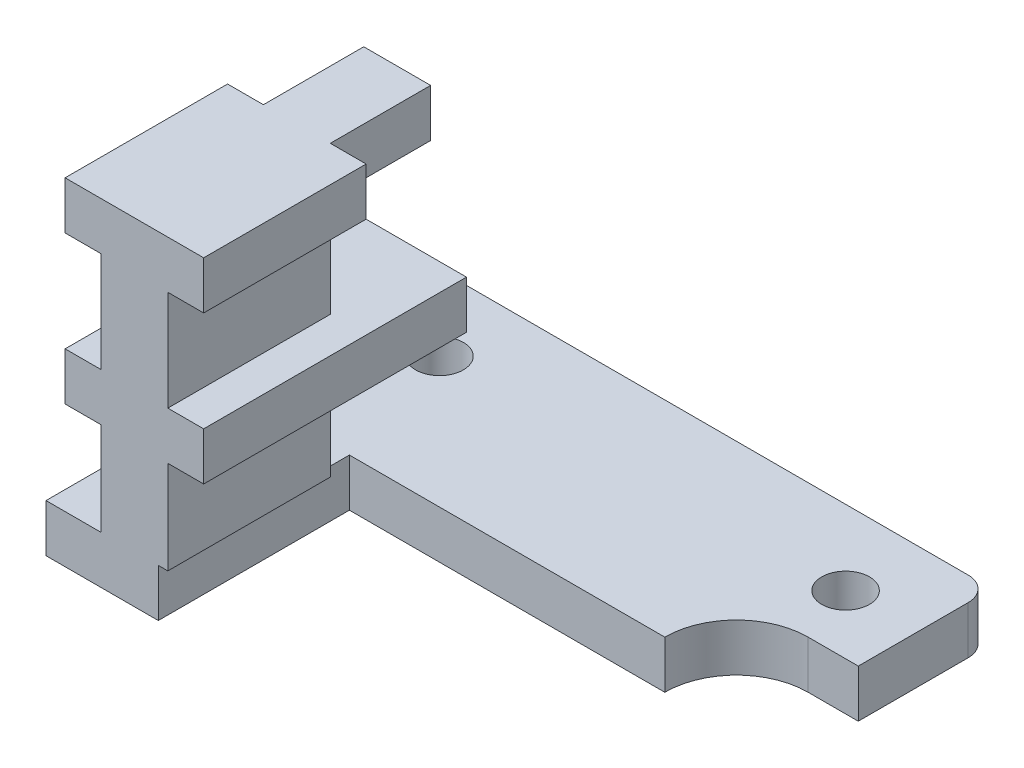
ISO-10303-21;
HEADER;
FILE_DESCRIPTION(('STEP AP214'),'2;1');
FILE_NAME('part.step','',(''),(''),'','','');
FILE_SCHEMA(('AUTOMOTIVE_DESIGN { 1 0 10303 214 1 1 1 1 }'));
ENDSEC;
DATA;
#1=APPLICATION_CONTEXT('core data for automotive mechanical design processes');
#2=APPLICATION_PROTOCOL_DEFINITION('international standard','automotive_design',2000,#1);
#3=PRODUCT_CONTEXT('',#1,'mechanical');
#4=PRODUCT('Part','Part','',(#3));
#5=PRODUCT_RELATED_PRODUCT_CATEGORY('part','',(#4));
#6=PRODUCT_DEFINITION_FORMATION('','',#4);
#7=PRODUCT_DEFINITION_CONTEXT('part definition',#1,'design');
#8=PRODUCT_DEFINITION('design','',#6,#7);
#9=PRODUCT_DEFINITION_SHAPE('','',#8);
#10=(LENGTH_UNIT() NAMED_UNIT(*) SI_UNIT(.MILLI.,.METRE.));
#11=(NAMED_UNIT(*) PLANE_ANGLE_UNIT() SI_UNIT($,.RADIAN.));
#12=(NAMED_UNIT(*) SI_UNIT($,.STERADIAN.) SOLID_ANGLE_UNIT());
#13=UNCERTAINTY_MEASURE_WITH_UNIT(LENGTH_MEASURE(1.E-05),#10,'distance_accuracy_value','');
#14=(GEOMETRIC_REPRESENTATION_CONTEXT(3) GLOBAL_UNCERTAINTY_ASSIGNED_CONTEXT((#13)) GLOBAL_UNIT_ASSIGNED_CONTEXT((#10,
#11,#12)) REPRESENTATION_CONTEXT('',''));
#15=CARTESIAN_POINT('',(0.,0.,0.));
#16=DIRECTION('',(0.,0.,1.));
#17=DIRECTION('',(1.,0.,0.));
#18=AXIS2_PLACEMENT_3D('',#15,#16,#17);
#19=CARTESIAN_POINT('',(-9.00000000000001,2.,1.2));
#20=DIRECTION('',(-1.,0.,0.));
#21=DIRECTION('',(0.,0.,1.));
#22=AXIS2_PLACEMENT_3D('',#19,#20,#21);
#23=PLANE('',#22);
#24=DIRECTION('',(0.,0.,-1.));
#25=VECTOR('',#24,1.);
#26=CARTESIAN_POINT('',(-9.00000000000001,7.9,1.2));
#27=LINE('',#26,#25);
#28=CARTESIAN_POINT('',(-9.00000000000001,7.9,8.));
#29=VERTEX_POINT('',#28);
#30=CARTESIAN_POINT('',(-9.00000000000001,7.9,1.2));
#31=VERTEX_POINT('',#30);
#32=EDGE_CURVE('E300',#29,#31,#27,.T.);
#33=ORIENTED_EDGE('',*,*,#32,.F.);
#34=DIRECTION('',(0.,-1.,0.));
#35=VECTOR('',#34,1.);
#36=CARTESIAN_POINT('',(-9.00000000000001,2.,8.));
#37=LINE('',#36,#35);
#38=CARTESIAN_POINT('',(-9.00000000000001,12.1,8.));
#39=VERTEX_POINT('',#38);
#40=EDGE_CURVE('E371',#39,#29,#37,.T.);
#41=ORIENTED_EDGE('',*,*,#40,.F.);
#42=DIRECTION('',(0.,0.,1.));
#43=VECTOR('',#42,1.);
#44=CARTESIAN_POINT('',(-9.00000000000001,12.1,1.2));
#45=LINE('',#44,#43);
#46=CARTESIAN_POINT('',(-9.00000000000001,12.1,1.2));
#47=VERTEX_POINT('',#46);
#48=EDGE_CURVE('E402',#47,#39,#45,.T.);
#49=ORIENTED_EDGE('',*,*,#48,.F.);
#50=DIRECTION('',(0.,-1.,0.));
#51=VECTOR('',#50,1.);
#52=CARTESIAN_POINT('',(-9.00000000000001,2.,1.2));
#53=LINE('',#52,#51);
#54=EDGE_CURVE('E335',#47,#31,#53,.T.);
#55=ORIENTED_EDGE('',*,*,#54,.T.);
#56=EDGE_LOOP('',(#33,#41,#49,#55));
#57=FACE_BOUND('',#56,.T.);
#58=ADVANCED_FACE('F39',(#57),#23,.T.);
#59=CARTESIAN_POINT('',(-6.2,2.,1.2));
#60=DIRECTION('',(1.,0.,0.));
#61=DIRECTION('',(0.,0.,-1.));
#62=AXIS2_PLACEMENT_3D('',#59,#60,#61);
#63=PLANE('',#62);
#64=DIRECTION('',(0.,0.,1.));
#65=VECTOR('',#64,1.);
#66=CARTESIAN_POINT('',(-6.2,7.9,1.2));
#67=LINE('',#66,#65);
#68=CARTESIAN_POINT('',(-6.2,7.9,1.2));
#69=VERTEX_POINT('',#68);
#70=CARTESIAN_POINT('',(-6.2,7.9,8.));
#71=VERTEX_POINT('',#70);
#72=EDGE_CURVE('E297',#69,#71,#67,.T.);
#73=ORIENTED_EDGE('',*,*,#72,.F.);
#74=DIRECTION('',(0.,1.,0.));
#75=VECTOR('',#74,1.);
#76=CARTESIAN_POINT('',(-6.2,2.,1.2));
#77=LINE('',#76,#75);
#78=CARTESIAN_POINT('',(-6.2,12.1,1.2));
#79=VERTEX_POINT('',#78);
#80=EDGE_CURVE('E344',#69,#79,#77,.T.);
#81=ORIENTED_EDGE('',*,*,#80,.T.);
#82=DIRECTION('',(0.,0.,1.));
#83=VECTOR('',#82,1.);
#84=CARTESIAN_POINT('',(-6.2,12.1,1.2));
#85=LINE('',#84,#83);
#86=CARTESIAN_POINT('',(-6.2,12.1,8.));
#87=VERTEX_POINT('',#86);
#88=EDGE_CURVE('E419',#79,#87,#85,.T.);
#89=ORIENTED_EDGE('',*,*,#88,.T.);
#90=DIRECTION('',(0.,1.,0.));
#91=VECTOR('',#90,1.);
#92=CARTESIAN_POINT('',(-6.2,2.,8.));
#93=LINE('',#92,#91);
#94=EDGE_CURVE('E378',#71,#87,#93,.T.);
#95=ORIENTED_EDGE('',*,*,#94,.F.);
#96=EDGE_LOOP('',(#73,#81,#89,#95));
#97=FACE_BOUND('',#96,.T.);
#98=ADVANCED_FACE('F618',(#97),#63,.T.);
#99=CARTESIAN_POINT('',(0.,0.,1.2));
#100=DIRECTION('',(0.,0.,1.));
#101=DIRECTION('',(1.,0.,0.));
#102=AXIS2_PLACEMENT_3D('',#99,#100,#101);
#103=PLANE('',#102);
#104=ORIENTED_EDGE('',*,*,#80,.F.);
#105=DIRECTION('',(-1.,0.,0.));
#106=VECTOR('',#105,1.);
#107=CARTESIAN_POINT('',(0.,7.9,1.2));
#108=LINE('',#107,#106);
#109=EDGE_CURVE('E11',#69,#31,#108,.T.);
#110=ORIENTED_EDGE('',*,*,#109,.T.);
#111=ORIENTED_EDGE('',*,*,#54,.F.);
#112=DIRECTION('',(1.,0.,0.));
#113=VECTOR('',#112,1.);
#114=CARTESIAN_POINT('',(0.,12.1,1.2));
#115=LINE('',#114,#113);
#116=EDGE_CURVE('E549',#47,#79,#115,.T.);
#117=ORIENTED_EDGE('',*,*,#116,.T.);
#118=EDGE_LOOP('',(#104,#110,#111,#117));
#119=FACE_BOUND('',#118,.T.);
#120=ADVANCED_FACE('F634',(#119),#103,.F.);
#121=DIRECTION('',(-1.,0.,0.));
#122=VECTOR('',#121,1.);
#123=CARTESIAN_POINT('',(-6.6,14.1,1.2));
#124=LINE('',#123,#122);
#125=CARTESIAN_POINT('',(-9.00000000000001,14.1,1.2));
#126=VERTEX_POINT('',#125);
#127=CARTESIAN_POINT('',(-10.5,14.1,1.2));
#128=VERTEX_POINT('',#127);
#129=EDGE_CURVE('E357',#126,#128,#124,.T.);
#130=ORIENTED_EDGE('',*,*,#129,.F.);
#131=DIRECTION('',(0.,-1.,0.));
#132=VECTOR('',#131,1.);
#133=CARTESIAN_POINT('',(-9.00000000000001,0.,1.2));
#134=LINE('',#133,#132);
#135=EDGE_CURVE('E557',#126,#47,#134,.T.);
#136=ORIENTED_EDGE('',*,*,#135,.T.);
#137=DIRECTION('',(1.,0.,0.));
#138=VECTOR('',#137,1.);
#139=CARTESIAN_POINT('',(-6.6,12.1,1.2));
#140=LINE('',#139,#138);
#141=CARTESIAN_POINT('',(-10.5,12.1,1.2));
#142=VERTEX_POINT('',#141);
#143=EDGE_CURVE('E366',#142,#47,#140,.T.);
#144=ORIENTED_EDGE('',*,*,#143,.F.);
#145=DIRECTION('',(0.,-1.,0.));
#146=VECTOR('',#145,1.);
#147=CARTESIAN_POINT('',(-10.5,2.,1.2));
#148=LINE('',#147,#146);
#149=EDGE_CURVE('E362',#128,#142,#148,.T.);
#150=ORIENTED_EDGE('',*,*,#149,.F.);
#151=EDGE_LOOP('',(#130,#136,#144,#150));
#152=FACE_BOUND('',#151,.T.);
#153=ADVANCED_FACE('F658',(#152),#103,.F.);
#154=DIRECTION('',(1.,0.,0.));
#155=VECTOR('',#154,1.);
#156=CARTESIAN_POINT('',(-6.6,12.1,1.2));
#157=LINE('',#156,#155);
#158=CARTESIAN_POINT('',(-4.7,12.1,1.2));
#159=VERTEX_POINT('',#158);
#160=EDGE_CURVE('E349',#79,#159,#157,.T.);
#161=ORIENTED_EDGE('',*,*,#160,.F.);
#162=DIRECTION('',(0.,1.,0.));
#163=VECTOR('',#162,1.);
#164=CARTESIAN_POINT('',(-6.2,0.,1.2));
#165=LINE('',#164,#163);
#166=CARTESIAN_POINT('',(-6.2,14.1,1.2));
#167=VERTEX_POINT('',#166);
#168=EDGE_CURVE('E553',#79,#167,#165,.T.);
#169=ORIENTED_EDGE('',*,*,#168,.T.);
#170=CARTESIAN_POINT('',(-4.70000000000001,14.1,1.2));
#171=VERTEX_POINT('',#170);
#172=EDGE_CURVE('E358',#171,#167,#124,.T.);
#173=ORIENTED_EDGE('',*,*,#172,.F.);
#174=DIRECTION('',(0.,1.,0.));
#175=VECTOR('',#174,1.);
#176=CARTESIAN_POINT('',(-4.7,2.,1.2));
#177=LINE('',#176,#175);
#178=EDGE_CURVE('E353',#159,#171,#177,.T.);
#179=ORIENTED_EDGE('',*,*,#178,.F.);
#180=EDGE_LOOP('',(#161,#169,#173,#179));
#181=FACE_BOUND('',#180,.T.);
#182=ADVANCED_FACE('F638',(#181),#103,.F.);
#183=CARTESIAN_POINT('',(9.6,2.,0.));
#184=DIRECTION('',(0.,1.,0.));
#185=DIRECTION('',(0.,0.,1.));
#186=AXIS2_PLACEMENT_3D('',#183,#184,#185);
#187=PLANE('',#186);
#188=DIRECTION('',(0.,0.,1.));
#189=VECTOR('',#188,1.);
#190=CARTESIAN_POINT('',(-9.00000000000001,2.,1.2));
#191=LINE('',#190,#189);
#192=CARTESIAN_POINT('',(-9.00000000000001,2.,1.2));
#193=VERTEX_POINT('',#192);
#194=CARTESIAN_POINT('',(-9.00000000000001,2.,8.));
#195=VERTEX_POINT('',#194);
#196=EDGE_CURVE('E370',#193,#195,#191,.T.);
#197=ORIENTED_EDGE('',*,*,#196,.F.);
#198=DIRECTION('',(1.,0.,0.));
#199=VECTOR('',#198,1.);
#200=CARTESIAN_POINT('',(-6.6,2.,1.2));
#201=LINE('',#200,#199);
#202=CARTESIAN_POINT('',(-6.6,2.,1.2));
#203=VERTEX_POINT('',#202);
#204=EDGE_CURVE('E340',#193,#203,#201,.T.);
#205=ORIENTED_EDGE('',*,*,#204,.T.);
#206=DIRECTION('',(0.,0.,-1.));
#207=VECTOR('',#206,1.);
#208=CARTESIAN_POINT('',(-6.6,2.,0.));
#209=LINE('',#208,#207);
#210=CARTESIAN_POINT('',(-6.6,2.,0.));
#211=VERTEX_POINT('',#210);
#212=EDGE_CURVE('E470',#203,#211,#209,.T.);
#213=ORIENTED_EDGE('',*,*,#212,.T.);
#214=DIRECTION('',(1.,0.,0.));
#215=VECTOR('',#214,1.);
#216=CARTESIAN_POINT('',(-6.6,2.,0.));
#217=LINE('',#216,#215);
#218=CARTESIAN_POINT('',(6.6,2.,0.));
#219=VERTEX_POINT('',#218);
#220=EDGE_CURVE('E474',#211,#219,#217,.T.);
#221=ORIENTED_EDGE('',*,*,#220,.T.);
#222=CARTESIAN_POINT('',(9.6,2.,0.));
#223=DIRECTION('',(0.,-1.,0.));
#224=DIRECTION('',(0.,0.,1.));
#225=AXIS2_PLACEMENT_3D('',#222,#223,#224);
#226=CIRCLE('',#225,3.);
#227=CARTESIAN_POINT('',(9.6,2.,-3.));
#228=VERTEX_POINT('',#227);
#229=EDGE_CURVE('E477',#219,#228,#226,.T.);
#230=ORIENTED_EDGE('',*,*,#229,.T.);
#231=DIRECTION('',(1.,0.,0.));
#232=VECTOR('',#231,1.);
#233=CARTESIAN_POINT('',(11.7,2.,-3.));
#234=LINE('',#233,#232);
#235=CARTESIAN_POINT('',(11.7,2.,-3.));
#236=VERTEX_POINT('',#235);
#237=EDGE_CURVE('E446',#228,#236,#234,.T.);
#238=ORIENTED_EDGE('',*,*,#237,.T.);
#239=DIRECTION('',(0.,0.,-1.));
#240=VECTOR('',#239,1.);
#241=CARTESIAN_POINT('',(11.7,2.,-3.));
#242=LINE('',#241,#240);
#243=CARTESIAN_POINT('',(11.7,2.,-7.6));
#244=VERTEX_POINT('',#243);
#245=EDGE_CURVE('E450',#236,#244,#242,.T.);
#246=ORIENTED_EDGE('',*,*,#245,.T.);
#247=CARTESIAN_POINT('',(10.7,2.,-7.6));
#248=DIRECTION('',(0.,1.,0.));
#249=DIRECTION('',(0.,0.,1.));
#250=AXIS2_PLACEMENT_3D('',#247,#248,#249);
#251=CIRCLE('',#250,1.);
#252=CARTESIAN_POINT('',(10.7,2.,-8.60000000000001));
#253=VERTEX_POINT('',#252);
#254=EDGE_CURVE('E454',#244,#253,#251,.T.);
#255=ORIENTED_EDGE('',*,*,#254,.T.);
#256=DIRECTION('',(-1.,0.,0.));
#257=VECTOR('',#256,1.);
#258=CARTESIAN_POINT('',(10.7,2.,-8.60000000000001));
#259=LINE('',#258,#257);
#260=CARTESIAN_POINT('',(-10.3,2.,-8.6));
#261=VERTEX_POINT('',#260);
#262=EDGE_CURVE('E457',#253,#261,#259,.T.);
#263=ORIENTED_EDGE('',*,*,#262,.T.);
#264=CARTESIAN_POINT('',(-10.3,2.,-7.6));
#265=DIRECTION('',(0.,1.,0.));
#266=DIRECTION('',(0.,0.,1.));
#267=AXIS2_PLACEMENT_3D('',#264,#265,#266);
#268=CIRCLE('',#267,1.);
#269=CARTESIAN_POINT('',(-11.3,2.,-7.6));
#270=VERTEX_POINT('',#269);
#271=EDGE_CURVE('E460',#261,#270,#268,.T.);
#272=ORIENTED_EDGE('',*,*,#271,.T.);
#273=DIRECTION('',(0.,0.,1.));
#274=VECTOR('',#273,1.);
#275=CARTESIAN_POINT('',(-11.3,2.,8.));
#276=LINE('',#275,#274);
#277=CARTESIAN_POINT('',(-11.3,2.,8.));
#278=VERTEX_POINT('',#277);
#279=EDGE_CURVE('E463',#270,#278,#276,.T.);
#280=ORIENTED_EDGE('',*,*,#279,.T.);
#281=DIRECTION('',(1.,0.,0.));
#282=VECTOR('',#281,1.);
#283=CARTESIAN_POINT('',(-6.6,2.,8.));
#284=LINE('',#283,#282);
#285=EDGE_CURVE('E466',#278,#195,#284,.T.);
#286=ORIENTED_EDGE('',*,*,#285,.T.);
#287=EDGE_LOOP('',(#197,#205,#213,#221,#230,#238,#246,#255,#263,#272,#280,#286));
#288=FACE_BOUND('',#287,.T.);
#289=CARTESIAN_POINT('',(-8.3,2.,-5.46956521739131));
#290=DIRECTION('',(0.,1.,0.));
#291=DIRECTION('',(0.,0.,1.));
#292=AXIS2_PLACEMENT_3D('',#289,#290,#291);
#293=CIRCLE('',#292,1.);
#294=CARTESIAN_POINT('',(-8.3,2.,-4.46956521739131));
#295=VERTEX_POINT('',#294);
#296=EDGE_CURVE('E438',#295,#295,#293,.T.);
#297=ORIENTED_EDGE('',*,*,#296,.F.);
#298=EDGE_LOOP('',(#297));
#299=FACE_BOUND('',#298,.T.);
#300=CARTESIAN_POINT('',(8.7,2.,-5.46956521739131));
#301=DIRECTION('',(0.,1.,0.));
#302=DIRECTION('',(0.,0.,1.));
#303=AXIS2_PLACEMENT_3D('',#300,#301,#302);
#304=CIRCLE('',#303,1.);
#305=CARTESIAN_POINT('',(8.7,2.,-4.46956521739131));
#306=VERTEX_POINT('',#305);
#307=EDGE_CURVE('E430',#306,#306,#304,.T.);
#308=ORIENTED_EDGE('',*,*,#307,.F.);
#309=EDGE_LOOP('',(#308));
#310=FACE_BOUND('',#309,.T.);
#311=ADVANCED_FACE('F585',(#288,#299,#310),#187,.T.);
#312=CARTESIAN_POINT('',(9.6,0.,0.));
#313=DIRECTION('',(0.,1.,0.));
#314=DIRECTION('',(0.,0.,1.));
#315=AXIS2_PLACEMENT_3D('',#312,#313,#314);
#316=PLANE('',#315);
#317=DIRECTION('',(1.,0.,0.));
#318=VECTOR('',#317,1.);
#319=CARTESIAN_POINT('',(11.7,0.,-3.));
#320=LINE('',#319,#318);
#321=CARTESIAN_POINT('',(9.6,0.,-3.));
#322=VERTEX_POINT('',#321);
#323=CARTESIAN_POINT('',(11.7,0.,-3.));
#324=VERTEX_POINT('',#323);
#325=EDGE_CURVE('E442',#322,#324,#320,.T.);
#326=ORIENTED_EDGE('',*,*,#325,.F.);
#327=CARTESIAN_POINT('',(9.6,0.,0.));
#328=DIRECTION('',(0.,-1.,0.));
#329=DIRECTION('',(0.,0.,1.));
#330=AXIS2_PLACEMENT_3D('',#327,#328,#329);
#331=CIRCLE('',#330,3.);
#332=CARTESIAN_POINT('',(6.6,0.,0.));
#333=VERTEX_POINT('',#332);
#334=EDGE_CURVE('E451',#333,#322,#331,.T.);
#335=ORIENTED_EDGE('',*,*,#334,.F.);
#336=DIRECTION('',(1.,0.,0.));
#337=VECTOR('',#336,1.);
#338=CARTESIAN_POINT('',(-6.6,0.,0.));
#339=LINE('',#338,#337);
#340=CARTESIAN_POINT('',(-6.6,0.,0.));
#341=VERTEX_POINT('',#340);
#342=EDGE_CURVE('E505',#341,#333,#339,.T.);
#343=ORIENTED_EDGE('',*,*,#342,.F.);
#344=DIRECTION('',(0.,0.,-1.));
#345=VECTOR('',#344,1.);
#346=CARTESIAN_POINT('',(-6.6,0.,0.));
#347=LINE('',#346,#345);
#348=CARTESIAN_POINT('',(-6.6,0.,8.));
#349=VERTEX_POINT('',#348);
#350=EDGE_CURVE('E502',#349,#341,#347,.T.);
#351=ORIENTED_EDGE('',*,*,#350,.F.);
#352=DIRECTION('',(1.,0.,0.));
#353=VECTOR('',#352,1.);
#354=CARTESIAN_POINT('',(-6.6,0.,8.));
#355=LINE('',#354,#353);
#356=CARTESIAN_POINT('',(-11.3,0.,8.));
#357=VERTEX_POINT('',#356);
#358=EDGE_CURVE('E499',#357,#349,#355,.T.);
#359=ORIENTED_EDGE('',*,*,#358,.F.);
#360=DIRECTION('',(0.,0.,1.));
#361=VECTOR('',#360,1.);
#362=CARTESIAN_POINT('',(-11.3,0.,8.));
#363=LINE('',#362,#361);
#364=CARTESIAN_POINT('',(-11.3,0.,-7.6));
#365=VERTEX_POINT('',#364);
#366=EDGE_CURVE('E496',#365,#357,#363,.T.);
#367=ORIENTED_EDGE('',*,*,#366,.F.);
#368=CARTESIAN_POINT('',(-10.3,0.,-7.6));
#369=DIRECTION('',(0.,1.,0.));
#370=DIRECTION('',(0.,0.,1.));
#371=AXIS2_PLACEMENT_3D('',#368,#369,#370);
#372=CIRCLE('',#371,1.);
#373=CARTESIAN_POINT('',(-10.3,0.,-8.6));
#374=VERTEX_POINT('',#373);
#375=EDGE_CURVE('E493',#374,#365,#372,.T.);
#376=ORIENTED_EDGE('',*,*,#375,.F.);
#377=DIRECTION('',(-1.,0.,0.));
#378=VECTOR('',#377,1.);
#379=CARTESIAN_POINT('',(10.7,0.,-8.60000000000001));
#380=LINE('',#379,#378);
#381=CARTESIAN_POINT('',(10.7,0.,-8.60000000000001));
#382=VERTEX_POINT('',#381);
#383=EDGE_CURVE('E490',#382,#374,#380,.T.);
#384=ORIENTED_EDGE('',*,*,#383,.F.);
#385=CARTESIAN_POINT('',(10.7,0.,-7.6));
#386=DIRECTION('',(0.,1.,0.));
#387=DIRECTION('',(0.,0.,1.));
#388=AXIS2_PLACEMENT_3D('',#385,#386,#387);
#389=CIRCLE('',#388,1.);
#390=CARTESIAN_POINT('',(11.7,0.,-7.6));
#391=VERTEX_POINT('',#390);
#392=EDGE_CURVE('E487',#391,#382,#389,.T.);
#393=ORIENTED_EDGE('',*,*,#392,.F.);
#394=DIRECTION('',(0.,0.,-1.));
#395=VECTOR('',#394,1.);
#396=CARTESIAN_POINT('',(11.7,0.,-3.));
#397=LINE('',#396,#395);
#398=EDGE_CURVE('E484',#324,#391,#397,.T.);
#399=ORIENTED_EDGE('',*,*,#398,.F.);
#400=EDGE_LOOP('',(#326,#335,#343,#351,#359,#367,#376,#384,#393,#399));
#401=FACE_BOUND('',#400,.T.);
#402=CARTESIAN_POINT('',(-8.3,0.,-5.46956521739131));
#403=DIRECTION('',(0.,1.,0.));
#404=DIRECTION('',(0.,0.,1.));
#405=AXIS2_PLACEMENT_3D('',#402,#403,#404);
#406=CIRCLE('',#405,1.);
#407=CARTESIAN_POINT('',(-8.3,0.,-4.46956521739131));
#408=VERTEX_POINT('',#407);
#409=EDGE_CURVE('E434',#408,#408,#406,.T.);
#410=ORIENTED_EDGE('',*,*,#409,.T.);
#411=EDGE_LOOP('',(#410));
#412=FACE_BOUND('',#411,.T.);
#413=CARTESIAN_POINT('',(8.7,0.,-5.46956521739131));
#414=DIRECTION('',(0.,1.,0.));
#415=DIRECTION('',(0.,0.,1.));
#416=AXIS2_PLACEMENT_3D('',#413,#414,#415);
#417=CIRCLE('',#416,1.);
#418=CARTESIAN_POINT('',(8.7,0.,-4.46956521739131));
#419=VERTEX_POINT('',#418);
#420=EDGE_CURVE('E405',#419,#419,#417,.T.);
#421=ORIENTED_EDGE('',*,*,#420,.T.);
#422=EDGE_LOOP('',(#421));
#423=FACE_BOUND('',#422,.T.);
#424=ADVANCED_FACE('F598',(#401,#412,#423),#316,.F.);
#425=CARTESIAN_POINT('',(11.7,2.,-3.));
#426=DIRECTION('',(0.,0.,-1.));
#427=DIRECTION('',(-1.,0.,0.));
#428=AXIS2_PLACEMENT_3D('',#425,#426,#427);
#429=PLANE('',#428);
#430=ORIENTED_EDGE('',*,*,#325,.T.);
#431=DIRECTION('',(0.,-1.,0.));
#432=VECTOR('',#431,1.);
#433=CARTESIAN_POINT('',(11.7,2.,-3.));
#434=LINE('',#433,#432);
#435=EDGE_CURVE('E545',#236,#324,#434,.T.);
#436=ORIENTED_EDGE('',*,*,#435,.F.);
#437=ORIENTED_EDGE('',*,*,#237,.F.);
#438=DIRECTION('',(0.,-1.,0.));
#439=VECTOR('',#438,1.);
#440=CARTESIAN_POINT('',(9.6,2.,-3.));
#441=LINE('',#440,#439);
#442=EDGE_CURVE('E480',#228,#322,#441,.T.);
#443=ORIENTED_EDGE('',*,*,#442,.T.);
#444=EDGE_LOOP('',(#430,#436,#437,#443));
#445=FACE_BOUND('',#444,.T.);
#446=ADVANCED_FACE('F41',(#445),#429,.F.);
#447=CARTESIAN_POINT('',(11.7,2.,-3.));
#448=DIRECTION('',(-1.,0.,0.));
#449=DIRECTION('',(0.,0.,1.));
#450=AXIS2_PLACEMENT_3D('',#447,#448,#449);
#451=PLANE('',#450);
#452=ORIENTED_EDGE('',*,*,#398,.T.);
#453=DIRECTION('',(0.,-1.,0.));
#454=VECTOR('',#453,1.);
#455=CARTESIAN_POINT('',(11.7,2.,-7.6));
#456=LINE('',#455,#454);
#457=EDGE_CURVE('E541',#244,#391,#456,.T.);
#458=ORIENTED_EDGE('',*,*,#457,.F.);
#459=ORIENTED_EDGE('',*,*,#245,.F.);
#460=ORIENTED_EDGE('',*,*,#435,.T.);
#461=EDGE_LOOP('',(#452,#458,#459,#460));
#462=FACE_BOUND('',#461,.T.);
#463=ADVANCED_FACE('F728',(#462),#451,.F.);
#464=CARTESIAN_POINT('',(10.7,2.,-7.6));
#465=DIRECTION('',(0.,-1.,0.));
#466=DIRECTION('',(0.,0.,-1.));
#467=AXIS2_PLACEMENT_3D('',#464,#465,#466);
#468=CYLINDRICAL_SURFACE('',#467,1.);
#469=ORIENTED_EDGE('',*,*,#392,.T.);
#470=DIRECTION('',(0.,-1.,0.));
#471=VECTOR('',#470,1.);
#472=CARTESIAN_POINT('',(10.7,2.,-8.60000000000001));
#473=LINE('',#472,#471);
#474=EDGE_CURVE('E537',#253,#382,#473,.T.);
#475=ORIENTED_EDGE('',*,*,#474,.F.);
#476=ORIENTED_EDGE('',*,*,#254,.F.);
#477=ORIENTED_EDGE('',*,*,#457,.T.);
#478=EDGE_LOOP('',(#469,#475,#476,#477));
#479=FACE_BOUND('',#478,.T.);
#480=ADVANCED_FACE('F725',(#479),#468,.T.);
#481=CARTESIAN_POINT('',(10.7,2.,-8.60000000000001));
#482=DIRECTION('',(0.,0.,1.));
#483=DIRECTION('',(1.,0.,0.));
#484=AXIS2_PLACEMENT_3D('',#481,#482,#483);
#485=PLANE('',#484);
#486=ORIENTED_EDGE('',*,*,#383,.T.);
#487=DIRECTION('',(0.,-1.,0.));
#488=VECTOR('',#487,1.);
#489=CARTESIAN_POINT('',(-10.3,2.,-8.6));
#490=LINE('',#489,#488);
#491=EDGE_CURVE('E533',#261,#374,#490,.T.);
#492=ORIENTED_EDGE('',*,*,#491,.F.);
#493=ORIENTED_EDGE('',*,*,#262,.F.);
#494=ORIENTED_EDGE('',*,*,#474,.T.);
#495=EDGE_LOOP('',(#486,#492,#493,#494));
#496=FACE_BOUND('',#495,.T.);
#497=ADVANCED_FACE('F721',(#496),#485,.F.);
#498=CARTESIAN_POINT('',(-10.3,2.,-7.6));
#499=DIRECTION('',(0.,-1.,0.));
#500=DIRECTION('',(0.,0.,-1.));
#501=AXIS2_PLACEMENT_3D('',#498,#499,#500);
#502=CYLINDRICAL_SURFACE('',#501,1.);
#503=ORIENTED_EDGE('',*,*,#375,.T.);
#504=DIRECTION('',(0.,-1.,0.));
#505=VECTOR('',#504,1.);
#506=CARTESIAN_POINT('',(-11.3,2.,-7.6));
#507=LINE('',#506,#505);
#508=EDGE_CURVE('E529',#270,#365,#507,.T.);
#509=ORIENTED_EDGE('',*,*,#508,.F.);
#510=ORIENTED_EDGE('',*,*,#271,.F.);
#511=ORIENTED_EDGE('',*,*,#491,.T.);
#512=EDGE_LOOP('',(#503,#509,#510,#511));
#513=FACE_BOUND('',#512,.T.);
#514=ADVANCED_FACE('F718',(#513),#502,.T.);
#515=CARTESIAN_POINT('',(-11.3,2.,8.));
#516=DIRECTION('',(1.,0.,0.));
#517=DIRECTION('',(0.,0.,-1.));
#518=AXIS2_PLACEMENT_3D('',#515,#516,#517);
#519=PLANE('',#518);
#520=ORIENTED_EDGE('',*,*,#366,.T.);
#521=DIRECTION('',(0.,-1.,0.));
#522=VECTOR('',#521,1.);
#523=CARTESIAN_POINT('',(-11.3,2.,8.));
#524=LINE('',#523,#522);
#525=EDGE_CURVE('E525',#278,#357,#524,.T.);
#526=ORIENTED_EDGE('',*,*,#525,.F.);
#527=ORIENTED_EDGE('',*,*,#279,.F.);
#528=ORIENTED_EDGE('',*,*,#508,.T.);
#529=EDGE_LOOP('',(#520,#526,#527,#528));
#530=FACE_BOUND('',#529,.T.);
#531=ADVANCED_FACE('F592',(#530),#519,.F.);
#532=CARTESIAN_POINT('',(-6.6,2.,8.));
#533=DIRECTION('',(0.,0.,-1.));
#534=DIRECTION('',(-1.,0.,0.));
#535=AXIS2_PLACEMENT_3D('',#532,#533,#534);
#536=PLANE('',#535);
#537=CARTESIAN_POINT('',(-6.2,2.,8.));
#538=VERTEX_POINT('',#537);
#539=CARTESIAN_POINT('',(-6.2,5.9,8.));
#540=VERTEX_POINT('',#539);
#541=EDGE_CURVE('E379',#538,#540,#93,.T.);
#542=ORIENTED_EDGE('',*,*,#541,.T.);
#543=DIRECTION('',(1.,0.,0.));
#544=VECTOR('',#543,1.);
#545=CARTESIAN_POINT('',(-10.5,5.9,8.));
#546=LINE('',#545,#544);
#547=CARTESIAN_POINT('',(-4.7,5.9,8.));
#548=VERTEX_POINT('',#547);
#549=EDGE_CURVE('E278',#540,#548,#546,.T.);
#550=ORIENTED_EDGE('',*,*,#549,.T.);
#551=DIRECTION('',(0.,1.,0.));
#552=VECTOR('',#551,1.);
#553=CARTESIAN_POINT('',(-4.7,5.9,8.));
#554=LINE('',#553,#552);
#555=CARTESIAN_POINT('',(-4.7,7.9,8.));
#556=VERTEX_POINT('',#555);
#557=EDGE_CURVE('E281',#548,#556,#554,.T.);
#558=ORIENTED_EDGE('',*,*,#557,.T.);
#559=DIRECTION('',(-1.,0.,0.));
#560=VECTOR('',#559,1.);
#561=CARTESIAN_POINT('',(-10.5,7.9,8.));
#562=LINE('',#561,#560);
#563=EDGE_CURVE('E264',#556,#71,#562,.T.);
#564=ORIENTED_EDGE('',*,*,#563,.T.);
#565=ORIENTED_EDGE('',*,*,#94,.T.);
#566=DIRECTION('',(1.,0.,0.));
#567=VECTOR('',#566,1.);
#568=CARTESIAN_POINT('',(-6.6,12.1,8.));
#569=LINE('',#568,#567);
#570=CARTESIAN_POINT('',(-4.7,12.1,8.));
#571=VERTEX_POINT('',#570);
#572=EDGE_CURVE('E383',#87,#571,#569,.T.);
#573=ORIENTED_EDGE('',*,*,#572,.T.);
#574=DIRECTION('',(0.,1.,0.));
#575=VECTOR('',#574,1.);
#576=CARTESIAN_POINT('',(-4.7,2.,8.));
#577=LINE('',#576,#575);
#578=CARTESIAN_POINT('',(-4.70000000000001,14.1,8.));
#579=VERTEX_POINT('',#578);
#580=EDGE_CURVE('E387',#571,#579,#577,.T.);
#581=ORIENTED_EDGE('',*,*,#580,.T.);
#582=DIRECTION('',(-1.,0.,0.));
#583=VECTOR('',#582,1.);
#584=CARTESIAN_POINT('',(-6.6,14.1,8.));
#585=LINE('',#584,#583);
#586=CARTESIAN_POINT('',(-10.5,14.1,8.));
#587=VERTEX_POINT('',#586);
#588=EDGE_CURVE('E391',#579,#587,#585,.T.);
#589=ORIENTED_EDGE('',*,*,#588,.T.);
#590=DIRECTION('',(0.,-1.,0.));
#591=VECTOR('',#590,1.);
#592=CARTESIAN_POINT('',(-10.5,2.,8.));
#593=LINE('',#592,#591);
#594=CARTESIAN_POINT('',(-10.5,12.1,8.));
#595=VERTEX_POINT('',#594);
#596=EDGE_CURVE('E394',#587,#595,#593,.T.);
#597=ORIENTED_EDGE('',*,*,#596,.T.);
#598=DIRECTION('',(1.,0.,0.));
#599=VECTOR('',#598,1.);
#600=CARTESIAN_POINT('',(-6.6,12.1,8.));
#601=LINE('',#600,#599);
#602=EDGE_CURVE('E398',#595,#39,#601,.T.);
#603=ORIENTED_EDGE('',*,*,#602,.T.);
#604=ORIENTED_EDGE('',*,*,#40,.T.);
#605=CARTESIAN_POINT('',(-10.5,7.9,8.));
#606=VERTEX_POINT('',#605);
#607=EDGE_CURVE('E268',#29,#606,#562,.T.);
#608=ORIENTED_EDGE('',*,*,#607,.T.);
#609=DIRECTION('',(0.,-1.,0.));
#610=VECTOR('',#609,1.);
#611=CARTESIAN_POINT('',(-10.5,5.9,8.));
#612=LINE('',#611,#610);
#613=CARTESIAN_POINT('',(-10.5,5.9,8.));
#614=VERTEX_POINT('',#613);
#615=EDGE_CURVE('E275',#606,#614,#612,.T.);
#616=ORIENTED_EDGE('',*,*,#615,.T.);
#617=CARTESIAN_POINT('',(-9.00000000000001,5.9,8.));
#618=VERTEX_POINT('',#617);
#619=EDGE_CURVE('E240',#614,#618,#546,.T.);
#620=ORIENTED_EDGE('',*,*,#619,.T.);
#621=EDGE_CURVE('E324',#618,#195,#37,.T.);
#622=ORIENTED_EDGE('',*,*,#621,.T.);
#623=ORIENTED_EDGE('',*,*,#285,.F.);
#624=ORIENTED_EDGE('',*,*,#525,.T.);
#625=ORIENTED_EDGE('',*,*,#358,.T.);
#626=DIRECTION('',(0.,-1.,0.));
#627=VECTOR('',#626,1.);
#628=CARTESIAN_POINT('',(-6.6,2.,8.));
#629=LINE('',#628,#627);
#630=CARTESIAN_POINT('',(-6.6,2.,8.));
#631=VERTEX_POINT('',#630);
#632=EDGE_CURVE('E521',#631,#349,#629,.T.);
#633=ORIENTED_EDGE('',*,*,#632,.F.);
#634=DIRECTION('',(1.,0.,0.));
#635=VECTOR('',#634,1.);
#636=CARTESIAN_POINT('',(-6.6,2.,8.));
#637=LINE('',#636,#635);
#638=EDGE_CURVE('E375',#631,#538,#637,.T.);
#639=ORIENTED_EDGE('',*,*,#638,.T.);
#640=EDGE_LOOP('',(#542,#550,#558,#564,#565,#573,#581,#589,#597,#603,#604,#608,#616,#620,#622,
#623,#624,#625,#633,#639));
#641=FACE_BOUND('',#640,.T.);
#642=ADVANCED_FACE('F580',(#641),#536,.F.);
#643=CARTESIAN_POINT('',(-6.6,2.,0.));
#644=DIRECTION('',(-1.,0.,0.));
#645=DIRECTION('',(0.,0.,1.));
#646=AXIS2_PLACEMENT_3D('',#643,#644,#645);
#647=PLANE('',#646);
#648=ORIENTED_EDGE('',*,*,#350,.T.);
#649=DIRECTION('',(0.,-1.,0.));
#650=VECTOR('',#649,1.);
#651=CARTESIAN_POINT('',(-6.6,2.,0.));
#652=LINE('',#651,#650);
#653=EDGE_CURVE('E517',#211,#341,#652,.T.);
#654=ORIENTED_EDGE('',*,*,#653,.F.);
#655=ORIENTED_EDGE('',*,*,#212,.F.);
#656=EDGE_CURVE('E471',#631,#203,#209,.T.);
#657=ORIENTED_EDGE('',*,*,#656,.F.);
#658=ORIENTED_EDGE('',*,*,#632,.T.);
#659=EDGE_LOOP('',(#648,#654,#655,#657,#658));
#660=FACE_BOUND('',#659,.T.);
#661=ADVANCED_FACE('F605',(#660),#647,.F.);
#662=CARTESIAN_POINT('',(-6.6,2.,0.));
#663=DIRECTION('',(0.,0.,-1.));
#664=DIRECTION('',(-1.,0.,0.));
#665=AXIS2_PLACEMENT_3D('',#662,#663,#664);
#666=PLANE('',#665);
#667=ORIENTED_EDGE('',*,*,#342,.T.);
#668=DIRECTION('',(0.,-1.,0.));
#669=VECTOR('',#668,1.);
#670=CARTESIAN_POINT('',(6.6,2.,0.));
#671=LINE('',#670,#669);
#672=EDGE_CURVE('E513',#219,#333,#671,.T.);
#673=ORIENTED_EDGE('',*,*,#672,.F.);
#674=ORIENTED_EDGE('',*,*,#220,.F.);
#675=ORIENTED_EDGE('',*,*,#653,.T.);
#676=EDGE_LOOP('',(#667,#673,#674,#675));
#677=FACE_BOUND('',#676,.T.);
#678=ADVANCED_FACE('F609',(#677),#666,.F.);
#679=CARTESIAN_POINT('',(9.6,2.,0.));
#680=DIRECTION('',(0.,-1.,0.));
#681=DIRECTION('',(0.,0.,-1.));
#682=AXIS2_PLACEMENT_3D('',#679,#680,#681);
#683=CYLINDRICAL_SURFACE('',#682,3.);
#684=ORIENTED_EDGE('',*,*,#334,.T.);
#685=ORIENTED_EDGE('',*,*,#442,.F.);
#686=ORIENTED_EDGE('',*,*,#229,.F.);
#687=ORIENTED_EDGE('',*,*,#672,.T.);
#688=EDGE_LOOP('',(#684,#685,#686,#687));
#689=FACE_BOUND('',#688,.T.);
#690=ADVANCED_FACE('F698',(#689),#683,.F.);
#691=CARTESIAN_POINT('',(-8.3,2.,-5.46956521739131));
#692=DIRECTION('',(0.,-1.,0.));
#693=DIRECTION('',(0.,0.,-1.));
#694=AXIS2_PLACEMENT_3D('',#691,#692,#693);
#695=CYLINDRICAL_SURFACE('',#694,1.);
#696=ORIENTED_EDGE('',*,*,#296,.T.);
#697=EDGE_LOOP('',(#696));
#698=FACE_BOUND('',#697,.T.);
#699=ORIENTED_EDGE('',*,*,#409,.F.);
#700=EDGE_LOOP('',(#699));
#701=FACE_BOUND('',#700,.T.);
#702=ADVANCED_FACE('F693',(#698,#701),#695,.F.);
#703=CARTESIAN_POINT('',(8.7,2.,-5.46956521739131));
#704=DIRECTION('',(0.,-1.,0.));
#705=DIRECTION('',(0.,0.,-1.));
#706=AXIS2_PLACEMENT_3D('',#703,#704,#705);
#707=CYLINDRICAL_SURFACE('',#706,1.);
#708=ORIENTED_EDGE('',*,*,#307,.T.);
#709=EDGE_LOOP('',(#708));
#710=FACE_BOUND('',#709,.T.);
#711=ORIENTED_EDGE('',*,*,#420,.F.);
#712=EDGE_LOOP('',(#711));
#713=FACE_BOUND('',#712,.T.);
#714=ADVANCED_FACE('F686',(#710,#713),#707,.F.);
#715=DIRECTION('',(0.,0.,1.));
#716=VECTOR('',#715,1.);
#717=CARTESIAN_POINT('',(-9.00000000000001,5.9,1.2));
#718=LINE('',#717,#716);
#719=CARTESIAN_POINT('',(-9.00000000000001,5.9,1.2));
#720=VERTEX_POINT('',#719);
#721=EDGE_CURVE('E294',#720,#618,#718,.T.);
#722=ORIENTED_EDGE('',*,*,#721,.F.);
#723=EDGE_CURVE('E339',#720,#193,#53,.T.);
#724=ORIENTED_EDGE('',*,*,#723,.T.);
#725=ORIENTED_EDGE('',*,*,#196,.T.);
#726=ORIENTED_EDGE('',*,*,#621,.F.);
#727=EDGE_LOOP('',(#722,#724,#725,#726));
#728=FACE_BOUND('',#727,.T.);
#729=ADVANCED_FACE('F583',(#728),#23,.T.);
#730=CARTESIAN_POINT('',(-6.6,12.1,1.2));
#731=DIRECTION('',(0.,-1.,0.));
#732=DIRECTION('',(0.,0.,-1.));
#733=AXIS2_PLACEMENT_3D('',#730,#731,#732);
#734=PLANE('',#733);
#735=ORIENTED_EDGE('',*,*,#602,.F.);
#736=DIRECTION('',(0.,0.,1.));
#737=VECTOR('',#736,1.);
#738=CARTESIAN_POINT('',(-10.5,12.1,1.2));
#739=LINE('',#738,#737);
#740=EDGE_CURVE('E406',#142,#595,#739,.T.);
#741=ORIENTED_EDGE('',*,*,#740,.F.);
#742=ORIENTED_EDGE('',*,*,#143,.T.);
#743=ORIENTED_EDGE('',*,*,#48,.T.);
#744=EDGE_LOOP('',(#735,#741,#742,#743));
#745=FACE_BOUND('',#744,.T.);
#746=ADVANCED_FACE('F653',(#745),#734,.T.);
#747=CARTESIAN_POINT('',(-10.5,2.,1.2));
#748=DIRECTION('',(-1.,0.,0.));
#749=DIRECTION('',(0.,0.,1.));
#750=AXIS2_PLACEMENT_3D('',#747,#748,#749);
#751=PLANE('',#750);
#752=ORIENTED_EDGE('',*,*,#596,.F.);
#753=DIRECTION('',(0.,0.,1.));
#754=VECTOR('',#753,1.);
#755=CARTESIAN_POINT('',(-10.5,14.1,1.2));
#756=LINE('',#755,#754);
#757=EDGE_CURVE('E409',#128,#587,#756,.T.);
#758=ORIENTED_EDGE('',*,*,#757,.F.);
#759=ORIENTED_EDGE('',*,*,#149,.T.);
#760=ORIENTED_EDGE('',*,*,#740,.T.);
#761=EDGE_LOOP('',(#752,#758,#759,#760));
#762=FACE_BOUND('',#761,.T.);
#763=ADVANCED_FACE('F691',(#762),#751,.T.);
#764=CARTESIAN_POINT('',(-6.6,14.1,1.2));
#765=DIRECTION('',(0.,1.,0.));
#766=DIRECTION('',(0.,0.,1.));
#767=AXIS2_PLACEMENT_3D('',#764,#765,#766);
#768=PLANE('',#767);
#769=ORIENTED_EDGE('',*,*,#172,.T.);
#770=DIRECTION('',(0.,0.,1.));
#771=VECTOR('',#770,1.);
#772=CARTESIAN_POINT('',(-6.2,14.1,-3.));
#773=LINE('',#772,#771);
#774=CARTESIAN_POINT('',(-6.2,14.1,-3.));
#775=VERTEX_POINT('',#774);
#776=EDGE_CURVE('E325',#775,#167,#773,.T.);
#777=ORIENTED_EDGE('',*,*,#776,.F.);
#778=DIRECTION('',(-1.,0.,0.));
#779=VECTOR('',#778,1.);
#780=CARTESIAN_POINT('',(-9.00000000000001,14.1,-3.));
#781=LINE('',#780,#779);
#782=CARTESIAN_POINT('',(-9.00000000000001,14.1,-3.));
#783=VERTEX_POINT('',#782);
#784=EDGE_CURVE('E315',#775,#783,#781,.T.);
#785=ORIENTED_EDGE('',*,*,#784,.T.);
#786=DIRECTION('',(0.,0.,1.));
#787=VECTOR('',#786,1.);
#788=CARTESIAN_POINT('',(-9.00000000000001,14.1,-3.));
#789=LINE('',#788,#787);
#790=EDGE_CURVE('E320',#783,#126,#789,.T.);
#791=ORIENTED_EDGE('',*,*,#790,.T.);
#792=ORIENTED_EDGE('',*,*,#129,.T.);
#793=ORIENTED_EDGE('',*,*,#757,.T.);
#794=ORIENTED_EDGE('',*,*,#588,.F.);
#795=DIRECTION('',(0.,0.,1.));
#796=VECTOR('',#795,1.);
#797=CARTESIAN_POINT('',(-4.70000000000001,14.1,1.2));
#798=LINE('',#797,#796);
#799=EDGE_CURVE('E413',#171,#579,#798,.T.);
#800=ORIENTED_EDGE('',*,*,#799,.F.);
#801=EDGE_LOOP('',(#769,#777,#785,#791,#792,#793,#794,#800));
#802=FACE_BOUND('',#801,.T.);
#803=ADVANCED_FACE('F663',(#802),#768,.T.);
#804=CARTESIAN_POINT('',(-4.7,2.,1.2));
#805=DIRECTION('',(1.,0.,0.));
#806=DIRECTION('',(0.,1.,0.));
#807=AXIS2_PLACEMENT_3D('',#804,#805,#806);
#808=PLANE('',#807);
#809=ORIENTED_EDGE('',*,*,#580,.F.);
#810=DIRECTION('',(0.,0.,1.));
#811=VECTOR('',#810,1.);
#812=CARTESIAN_POINT('',(-4.7,12.1,1.2));
#813=LINE('',#812,#811);
#814=EDGE_CURVE('E416',#159,#571,#813,.T.);
#815=ORIENTED_EDGE('',*,*,#814,.F.);
#816=ORIENTED_EDGE('',*,*,#178,.T.);
#817=ORIENTED_EDGE('',*,*,#799,.T.);
#818=EDGE_LOOP('',(#809,#815,#816,#817));
#819=FACE_BOUND('',#818,.T.);
#820=ADVANCED_FACE('F641',(#819),#808,.T.);
#821=CARTESIAN_POINT('',(-6.6,12.1,1.2));
#822=DIRECTION('',(0.,-1.,0.));
#823=DIRECTION('',(0.,0.,-1.));
#824=AXIS2_PLACEMENT_3D('',#821,#822,#823);
#825=PLANE('',#824);
#826=ORIENTED_EDGE('',*,*,#572,.F.);
#827=ORIENTED_EDGE('',*,*,#88,.F.);
#828=ORIENTED_EDGE('',*,*,#160,.T.);
#829=ORIENTED_EDGE('',*,*,#814,.T.);
#830=EDGE_LOOP('',(#826,#827,#828,#829));
#831=FACE_BOUND('',#830,.T.);
#832=ADVANCED_FACE('F636',(#831),#825,.T.);
#833=DIRECTION('',(0.,0.,-1.));
#834=VECTOR('',#833,1.);
#835=CARTESIAN_POINT('',(-6.2,5.9,1.2));
#836=LINE('',#835,#834);
#837=CARTESIAN_POINT('',(-6.2,5.9,1.2));
#838=VERTEX_POINT('',#837);
#839=EDGE_CURVE('E55',#540,#838,#836,.T.);
#840=ORIENTED_EDGE('',*,*,#839,.F.);
#841=ORIENTED_EDGE('',*,*,#541,.F.);
#842=DIRECTION('',(0.,0.,1.));
#843=VECTOR('',#842,1.);
#844=CARTESIAN_POINT('',(-6.2,2.,1.2));
#845=LINE('',#844,#843);
#846=CARTESIAN_POINT('',(-6.2,2.,1.2));
#847=VERTEX_POINT('',#846);
#848=EDGE_CURVE('E423',#847,#538,#845,.T.);
#849=ORIENTED_EDGE('',*,*,#848,.F.);
#850=EDGE_CURVE('E345',#847,#838,#77,.T.);
#851=ORIENTED_EDGE('',*,*,#850,.T.);
#852=EDGE_LOOP('',(#840,#841,#849,#851));
#853=FACE_BOUND('',#852,.T.);
#854=ADVANCED_FACE('F566',(#853),#63,.T.);
#855=CARTESIAN_POINT('',(-6.6,2.,1.2));
#856=DIRECTION('',(0.,-1.,0.));
#857=DIRECTION('',(0.,0.,-1.));
#858=AXIS2_PLACEMENT_3D('',#855,#856,#857);
#859=PLANE('',#858);
#860=ORIENTED_EDGE('',*,*,#638,.F.);
#861=ORIENTED_EDGE('',*,*,#656,.T.);
#862=EDGE_CURVE('E63',#203,#847,#201,.T.);
#863=ORIENTED_EDGE('',*,*,#862,.T.);
#864=ORIENTED_EDGE('',*,*,#848,.T.);
#865=EDGE_LOOP('',(#860,#861,#863,#864));
#866=FACE_BOUND('',#865,.T.);
#867=ADVANCED_FACE('F569',(#866),#859,.T.);
#868=ORIENTED_EDGE('',*,*,#723,.F.);
#869=DIRECTION('',(1.,0.,0.));
#870=VECTOR('',#869,1.);
#871=CARTESIAN_POINT('',(0.,5.9,1.2));
#872=LINE('',#871,#870);
#873=EDGE_CURVE('E48',#720,#838,#872,.T.);
#874=ORIENTED_EDGE('',*,*,#873,.T.);
#875=ORIENTED_EDGE('',*,*,#850,.F.);
#876=ORIENTED_EDGE('',*,*,#862,.F.);
#877=ORIENTED_EDGE('',*,*,#204,.F.);
#878=EDGE_LOOP('',(#868,#874,#875,#876,#877));
#879=FACE_BOUND('',#878,.T.);
#880=ADVANCED_FACE('F562',(#879),#103,.F.);
#881=CARTESIAN_POINT('',(-9.00000000000001,12.1,-3.));
#882=DIRECTION('',(-1.,0.,0.));
#883=DIRECTION('',(0.,0.,1.));
#884=AXIS2_PLACEMENT_3D('',#881,#882,#883);
#885=PLANE('',#884);
#886=ORIENTED_EDGE('',*,*,#135,.F.);
#887=ORIENTED_EDGE('',*,*,#790,.F.);
#888=DIRECTION('',(0.,-1.,0.));
#889=VECTOR('',#888,1.);
#890=CARTESIAN_POINT('',(-9.00000000000001,12.1,-3.));
#891=LINE('',#890,#889);
#892=CARTESIAN_POINT('',(-9.00000000000001,12.1,-3.));
#893=VERTEX_POINT('',#892);
#894=EDGE_CURVE('E303',#783,#893,#891,.T.);
#895=ORIENTED_EDGE('',*,*,#894,.T.);
#896=DIRECTION('',(0.,0.,1.));
#897=VECTOR('',#896,1.);
#898=CARTESIAN_POINT('',(-9.00000000000001,12.1,-3.));
#899=LINE('',#898,#897);
#900=EDGE_CURVE('E319',#893,#47,#899,.T.);
#901=ORIENTED_EDGE('',*,*,#900,.T.);
#902=EDGE_LOOP('',(#886,#887,#895,#901));
#903=FACE_BOUND('',#902,.T.);
#904=ADVANCED_FACE('F660',(#903),#885,.T.);
#905=CARTESIAN_POINT('',(-6.2,12.1,-3.));
#906=DIRECTION('',(1.,0.,0.));
#907=DIRECTION('',(0.,0.,-1.));
#908=AXIS2_PLACEMENT_3D('',#905,#906,#907);
#909=PLANE('',#908);
#910=ORIENTED_EDGE('',*,*,#168,.F.);
#911=DIRECTION('',(0.,0.,1.));
#912=VECTOR('',#911,1.);
#913=CARTESIAN_POINT('',(-6.2,12.1,-3.));
#914=LINE('',#913,#912);
#915=CARTESIAN_POINT('',(-6.2,12.1,-3.));
#916=VERTEX_POINT('',#915);
#917=EDGE_CURVE('E328',#916,#79,#914,.T.);
#918=ORIENTED_EDGE('',*,*,#917,.F.);
#919=DIRECTION('',(0.,1.,0.));
#920=VECTOR('',#919,1.);
#921=CARTESIAN_POINT('',(-6.2,12.1,-3.));
#922=LINE('',#921,#920);
#923=EDGE_CURVE('E311',#916,#775,#922,.T.);
#924=ORIENTED_EDGE('',*,*,#923,.T.);
#925=ORIENTED_EDGE('',*,*,#776,.T.);
#926=EDGE_LOOP('',(#910,#918,#924,#925));
#927=FACE_BOUND('',#926,.T.);
#928=ADVANCED_FACE('F629',(#927),#909,.T.);
#929=CARTESIAN_POINT('',(-9.00000000000001,12.1,-3.));
#930=DIRECTION('',(0.,-1.,0.));
#931=DIRECTION('',(0.,0.,-1.));
#932=AXIS2_PLACEMENT_3D('',#929,#930,#931);
#933=PLANE('',#932);
#934=ORIENTED_EDGE('',*,*,#116,.F.);
#935=ORIENTED_EDGE('',*,*,#900,.F.);
#936=DIRECTION('',(1.,0.,0.));
#937=VECTOR('',#936,1.);
#938=CARTESIAN_POINT('',(-9.00000000000001,12.1,-3.));
#939=LINE('',#938,#937);
#940=EDGE_CURVE('E307',#893,#916,#939,.T.);
#941=ORIENTED_EDGE('',*,*,#940,.T.);
#942=ORIENTED_EDGE('',*,*,#917,.T.);
#943=EDGE_LOOP('',(#934,#935,#941,#942));
#944=FACE_BOUND('',#943,.T.);
#945=ADVANCED_FACE('F625',(#944),#933,.T.);
#946=CARTESIAN_POINT('',(0.,0.,-3.));
#947=DIRECTION('',(0.,0.,-1.));
#948=DIRECTION('',(-1.,0.,0.));
#949=AXIS2_PLACEMENT_3D('',#946,#947,#948);
#950=PLANE('',#949);
#951=ORIENTED_EDGE('',*,*,#894,.F.);
#952=ORIENTED_EDGE('',*,*,#784,.F.);
#953=ORIENTED_EDGE('',*,*,#923,.F.);
#954=ORIENTED_EDGE('',*,*,#940,.F.);
#955=EDGE_LOOP('',(#951,#952,#953,#954));
#956=FACE_BOUND('',#955,.T.);
#957=ADVANCED_FACE('F667',(#956),#950,.T.);
#958=CARTESIAN_POINT('',(-10.5,5.9,-3.));
#959=DIRECTION('',(-1.,0.,0.));
#960=DIRECTION('',(0.,0.,1.));
#961=AXIS2_PLACEMENT_3D('',#958,#959,#960);
#962=PLANE('',#961);
#963=ORIENTED_EDGE('',*,*,#615,.F.);
#964=DIRECTION('',(0.,0.,1.));
#965=VECTOR('',#964,1.);
#966=CARTESIAN_POINT('',(-10.5,7.9,-3.));
#967=LINE('',#966,#965);
#968=CARTESIAN_POINT('',(-10.5,7.9,-3.));
#969=VERTEX_POINT('',#968);
#970=EDGE_CURVE('E262',#969,#606,#967,.T.);
#971=ORIENTED_EDGE('',*,*,#970,.F.);
#972=DIRECTION('',(0.,-1.,0.));
#973=VECTOR('',#972,1.);
#974=CARTESIAN_POINT('',(-10.5,5.9,-3.));
#975=LINE('',#974,#973);
#976=CARTESIAN_POINT('',(-10.5,5.9,-3.));
#977=VERTEX_POINT('',#976);
#978=EDGE_CURVE('E254',#969,#977,#975,.T.);
#979=ORIENTED_EDGE('',*,*,#978,.T.);
#980=DIRECTION('',(0.,0.,1.));
#981=VECTOR('',#980,1.);
#982=CARTESIAN_POINT('',(-10.5,5.9,-3.));
#983=LINE('',#982,#981);
#984=EDGE_CURVE('E234',#977,#614,#983,.T.);
#985=ORIENTED_EDGE('',*,*,#984,.T.);
#986=EDGE_LOOP('',(#963,#971,#979,#985));
#987=FACE_BOUND('',#986,.T.);
#988=ADVANCED_FACE('F260',(#987),#962,.T.);
#989=CARTESIAN_POINT('',(-10.5,7.9,-3.));
#990=DIRECTION('',(0.,1.,0.));
#991=DIRECTION('',(0.,0.,1.));
#992=AXIS2_PLACEMENT_3D('',#989,#990,#991);
#993=PLANE('',#992);
#994=ORIENTED_EDGE('',*,*,#607,.F.);
#995=ORIENTED_EDGE('',*,*,#32,.T.);
#996=ORIENTED_EDGE('',*,*,#109,.F.);
#997=ORIENTED_EDGE('',*,*,#72,.T.);
#998=ORIENTED_EDGE('',*,*,#563,.F.);
#999=DIRECTION('',(0.,0.,1.));
#1000=VECTOR('',#999,1.);
#1001=CARTESIAN_POINT('',(-4.7,7.9,-3.));
#1002=LINE('',#1001,#1000);
#1003=CARTESIAN_POINT('',(-4.7,7.9,-3.));
#1004=VERTEX_POINT('',#1003);
#1005=EDGE_CURVE('E287',#1004,#556,#1002,.T.);
#1006=ORIENTED_EDGE('',*,*,#1005,.F.);
#1007=DIRECTION('',(-1.,0.,0.));
#1008=VECTOR('',#1007,1.);
#1009=CARTESIAN_POINT('',(-10.5,7.9,-3.));
#1010=LINE('',#1009,#1008);
#1011=EDGE_CURVE('E247',#1004,#969,#1010,.T.);
#1012=ORIENTED_EDGE('',*,*,#1011,.T.);
#1013=ORIENTED_EDGE('',*,*,#970,.T.);
#1014=EDGE_LOOP('',(#994,#995,#996,#997,#998,#1006,#1012,#1013));
#1015=FACE_BOUND('',#1014,.T.);
#1016=ADVANCED_FACE('F646',(#1015),#993,.T.);
#1017=CARTESIAN_POINT('',(-4.7,5.9,-3.));
#1018=DIRECTION('',(1.,0.,0.));
#1019=DIRECTION('',(0.,0.,-1.));
#1020=AXIS2_PLACEMENT_3D('',#1017,#1018,#1019);
#1021=PLANE('',#1020);
#1022=ORIENTED_EDGE('',*,*,#557,.F.);
#1023=DIRECTION('',(0.,0.,1.));
#1024=VECTOR('',#1023,1.);
#1025=CARTESIAN_POINT('',(-4.7,5.9,-3.));
#1026=LINE('',#1025,#1024);
#1027=CARTESIAN_POINT('',(-4.7,5.9,-3.));
#1028=VERTEX_POINT('',#1027);
#1029=EDGE_CURVE('E246',#1028,#548,#1026,.T.);
#1030=ORIENTED_EDGE('',*,*,#1029,.F.);
#1031=DIRECTION('',(0.,1.,0.));
#1032=VECTOR('',#1031,1.);
#1033=CARTESIAN_POINT('',(-4.7,5.9,-3.));
#1034=LINE('',#1033,#1032);
#1035=EDGE_CURVE('E257',#1028,#1004,#1034,.T.);
#1036=ORIENTED_EDGE('',*,*,#1035,.T.);
#1037=ORIENTED_EDGE('',*,*,#1005,.T.);
#1038=EDGE_LOOP('',(#1022,#1030,#1036,#1037));
#1039=FACE_BOUND('',#1038,.T.);
#1040=ADVANCED_FACE('F921',(#1039),#1021,.T.);
#1041=CARTESIAN_POINT('',(-10.5,5.9,-3.));
#1042=DIRECTION('',(0.,-1.,0.));
#1043=DIRECTION('',(0.,0.,-1.));
#1044=AXIS2_PLACEMENT_3D('',#1041,#1042,#1043);
#1045=PLANE('',#1044);
#1046=ORIENTED_EDGE('',*,*,#873,.F.);
#1047=ORIENTED_EDGE('',*,*,#721,.T.);
#1048=ORIENTED_EDGE('',*,*,#619,.F.);
#1049=ORIENTED_EDGE('',*,*,#984,.F.);
#1050=DIRECTION('',(1.,0.,0.));
#1051=VECTOR('',#1050,1.);
#1052=CARTESIAN_POINT('',(-10.5,5.9,-3.));
#1053=LINE('',#1052,#1051);
#1054=EDGE_CURVE('E238',#977,#1028,#1053,.T.);
#1055=ORIENTED_EDGE('',*,*,#1054,.T.);
#1056=ORIENTED_EDGE('',*,*,#1029,.T.);
#1057=ORIENTED_EDGE('',*,*,#549,.F.);
#1058=ORIENTED_EDGE('',*,*,#839,.T.);
#1059=EDGE_LOOP('',(#1046,#1047,#1048,#1049,#1055,#1056,#1057,#1058));
#1060=FACE_BOUND('',#1059,.T.);
#1061=ADVANCED_FACE('F236',(#1060),#1045,.T.);
#1062=CARTESIAN_POINT('',(0.,0.,-3.));
#1063=DIRECTION('',(0.,0.,-1.));
#1064=DIRECTION('',(-1.,0.,0.));
#1065=AXIS2_PLACEMENT_3D('',#1062,#1063,#1064);
#1066=PLANE('',#1065);
#1067=ORIENTED_EDGE('',*,*,#978,.F.);
#1068=ORIENTED_EDGE('',*,*,#1011,.F.);
#1069=ORIENTED_EDGE('',*,*,#1035,.F.);
#1070=ORIENTED_EDGE('',*,*,#1054,.F.);
#1071=EDGE_LOOP('',(#1067,#1068,#1069,#1070));
#1072=FACE_BOUND('',#1071,.T.);
#1073=ADVANCED_FACE('F252',(#1072),#1066,.T.);
#1074=CLOSED_SHELL('',(#58,#98,#120,#153,#182,#311,#424,#446,#463,#480,#497,#514,#531,#642,#661,
#678,#690,#702,#714,#729,#746,#763,#803,#820,#832,#854,#867,#880,#904,#928,#945,#957,#988,#1016,
#1040,#1061,#1073));
#1075=MANIFOLD_SOLID_BREP('B2',#1074);
#1076=ADVANCED_BREP_SHAPE_REPRESENTATION('',(#18,#1075),#14);
#1077=SHAPE_DEFINITION_REPRESENTATION(#9,#1076);
ENDSEC;
END-ISO-10303-21;
